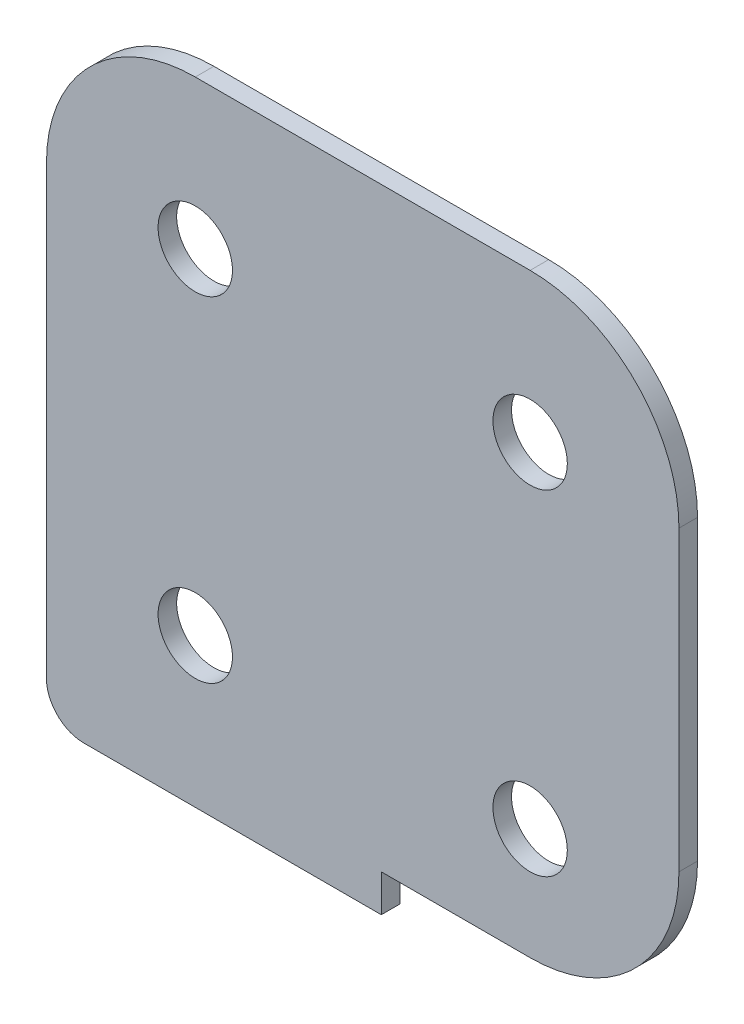
ISO-10303-21;
HEADER;
FILE_DESCRIPTION(('STEP AP214'),'2;1');
FILE_NAME('part.step','',(''),(''),'','','');
FILE_SCHEMA(('AUTOMOTIVE_DESIGN { 1 0 10303 214 1 1 1 1 }'));
ENDSEC;
DATA;
#1=APPLICATION_CONTEXT('core data for automotive mechanical design processes');
#2=APPLICATION_PROTOCOL_DEFINITION('international standard','automotive_design',2000,#1);
#3=PRODUCT_CONTEXT('',#1,'mechanical');
#4=PRODUCT('Part','Part','',(#3));
#5=PRODUCT_RELATED_PRODUCT_CATEGORY('part','',(#4));
#6=PRODUCT_DEFINITION_FORMATION('','',#4);
#7=PRODUCT_DEFINITION_CONTEXT('part definition',#1,'design');
#8=PRODUCT_DEFINITION('design','',#6,#7);
#9=PRODUCT_DEFINITION_SHAPE('','',#8);
#10=(LENGTH_UNIT() NAMED_UNIT(*) SI_UNIT(.MILLI.,.METRE.));
#11=(NAMED_UNIT(*) PLANE_ANGLE_UNIT() SI_UNIT($,.RADIAN.));
#12=(NAMED_UNIT(*) SI_UNIT($,.STERADIAN.) SOLID_ANGLE_UNIT());
#13=UNCERTAINTY_MEASURE_WITH_UNIT(LENGTH_MEASURE(1.E-05),#10,'distance_accuracy_value','');
#14=(GEOMETRIC_REPRESENTATION_CONTEXT(3) GLOBAL_UNCERTAINTY_ASSIGNED_CONTEXT((#13)) GLOBAL_UNIT_ASSIGNED_CONTEXT((#10,
#11,#12)) REPRESENTATION_CONTEXT('',''));
#15=CARTESIAN_POINT('',(0.,0.,0.));
#16=DIRECTION('',(0.,0.,1.));
#17=DIRECTION('',(1.,0.,0.));
#18=AXIS2_PLACEMENT_3D('',#15,#16,#17);
#19=CARTESIAN_POINT('',(0.,0.,1.5875));
#20=DIRECTION('',(0.,1.,0.));
#21=DIRECTION('',(0.,0.,1.));
#22=AXIS2_PLACEMENT_3D('',#19,#20,#21);
#23=PLANE('',#22);
#24=DIRECTION('',(1.,0.,0.));
#25=VECTOR('',#24,1.);
#26=CARTESIAN_POINT('',(0.,0.,0.));
#27=LINE('',#26,#25);
#28=CARTESIAN_POINT('',(-25.4,0.,0.));
#29=VERTEX_POINT('',#28);
#30=CARTESIAN_POINT('',(-12.7,0.,0.));
#31=VERTEX_POINT('',#30);
#32=EDGE_CURVE('E141',#29,#31,#27,.T.);
#33=ORIENTED_EDGE('',*,*,#32,.T.);
#34=DIRECTION('',(0.,0.,-1.));
#35=VECTOR('',#34,1.);
#36=CARTESIAN_POINT('',(-12.7,0.,1.5875));
#37=LINE('',#36,#35);
#38=CARTESIAN_POINT('',(-12.7,0.,1.5875));
#39=VERTEX_POINT('',#38);
#40=EDGE_CURVE('E121',#39,#31,#37,.T.);
#41=ORIENTED_EDGE('',*,*,#40,.F.);
#42=DIRECTION('',(1.,0.,0.));
#43=VECTOR('',#42,1.);
#44=CARTESIAN_POINT('',(0.,0.,1.5875));
#45=LINE('',#44,#43);
#46=CARTESIAN_POINT('',(-25.4,0.,1.5875));
#47=VERTEX_POINT('',#46);
#48=EDGE_CURVE('E129',#47,#39,#45,.T.);
#49=ORIENTED_EDGE('',*,*,#48,.F.);
#50=DIRECTION('',(0.,0.,-1.));
#51=VECTOR('',#50,1.);
#52=CARTESIAN_POINT('',(-25.4,0.,1.5875));
#53=LINE('',#52,#51);
#54=EDGE_CURVE('E172',#47,#29,#53,.T.);
#55=ORIENTED_EDGE('',*,*,#54,.T.);
#56=EDGE_LOOP('',(#33,#41,#49,#55));
#57=FACE_BOUND('',#56,.T.);
#58=ADVANCED_FACE('F41',(#57),#23,.F.);
#59=CARTESIAN_POINT('',(-12.7,12.7,1.5875));
#60=DIRECTION('',(0.,0.,-1.));
#61=DIRECTION('',(-1.,0.,0.));
#62=AXIS2_PLACEMENT_3D('',#59,#60,#61);
#63=CYLINDRICAL_SURFACE('',#62,12.7);
#64=CARTESIAN_POINT('',(-12.7,12.7,0.));
#65=DIRECTION('',(0.,0.,1.));
#66=DIRECTION('',(1.,0.,0.));
#67=AXIS2_PLACEMENT_3D('',#64,#65,#66);
#68=CIRCLE('',#67,12.7);
#69=CARTESIAN_POINT('',(0.,12.7,0.));
#70=VERTEX_POINT('',#69);
#71=EDGE_CURVE('E201',#31,#70,#68,.T.);
#72=ORIENTED_EDGE('',*,*,#71,.T.);
#73=DIRECTION('',(0.,0.,-1.));
#74=VECTOR('',#73,1.);
#75=CARTESIAN_POINT('',(0.,12.7,1.5875));
#76=LINE('',#75,#74);
#77=CARTESIAN_POINT('',(0.,12.7,1.5875));
#78=VERTEX_POINT('',#77);
#79=EDGE_CURVE('E124',#78,#70,#76,.T.);
#80=ORIENTED_EDGE('',*,*,#79,.F.);
#81=CARTESIAN_POINT('',(-12.7,12.7,1.5875));
#82=DIRECTION('',(0.,0.,1.));
#83=DIRECTION('',(1.,0.,0.));
#84=AXIS2_PLACEMENT_3D('',#81,#82,#83);
#85=CIRCLE('',#84,12.7);
#86=EDGE_CURVE('E117',#39,#78,#85,.T.);
#87=ORIENTED_EDGE('',*,*,#86,.F.);
#88=ORIENTED_EDGE('',*,*,#40,.T.);
#89=EDGE_LOOP('',(#72,#80,#87,#88));
#90=FACE_BOUND('',#89,.T.);
#91=ADVANCED_FACE('F119',(#90),#63,.T.);
#92=CARTESIAN_POINT('',(0.,0.,1.5875));
#93=DIRECTION('',(-1.,0.,0.));
#94=DIRECTION('',(0.,0.,1.));
#95=AXIS2_PLACEMENT_3D('',#92,#93,#94);
#96=PLANE('',#95);
#97=DIRECTION('',(0.,1.,0.));
#98=VECTOR('',#97,1.);
#99=CARTESIAN_POINT('',(0.,0.,0.));
#100=LINE('',#99,#98);
#101=CARTESIAN_POINT('',(0.,38.1,0.));
#102=VERTEX_POINT('',#101);
#103=EDGE_CURVE('E197',#70,#102,#100,.T.);
#104=ORIENTED_EDGE('',*,*,#103,.T.);
#105=DIRECTION('',(0.,0.,-1.));
#106=VECTOR('',#105,1.);
#107=CARTESIAN_POINT('',(0.,38.1,1.5875));
#108=LINE('',#107,#106);
#109=CARTESIAN_POINT('',(0.,38.1,1.5875));
#110=VERTEX_POINT('',#109);
#111=EDGE_CURVE('E149',#110,#102,#108,.T.);
#112=ORIENTED_EDGE('',*,*,#111,.F.);
#113=DIRECTION('',(0.,1.,0.));
#114=VECTOR('',#113,1.);
#115=CARTESIAN_POINT('',(0.,0.,1.5875));
#116=LINE('',#115,#114);
#117=EDGE_CURVE('E128',#78,#110,#116,.T.);
#118=ORIENTED_EDGE('',*,*,#117,.F.);
#119=ORIENTED_EDGE('',*,*,#79,.T.);
#120=EDGE_LOOP('',(#104,#112,#118,#119));
#121=FACE_BOUND('',#120,.T.);
#122=ADVANCED_FACE('F291',(#121),#96,.F.);
#123=CARTESIAN_POINT('',(-12.7,38.1,1.5875));
#124=DIRECTION('',(0.,0.,-1.));
#125=DIRECTION('',(-1.,0.,0.));
#126=AXIS2_PLACEMENT_3D('',#123,#124,#125);
#127=CYLINDRICAL_SURFACE('',#126,12.7);
#128=CARTESIAN_POINT('',(-12.7,38.1,0.));
#129=DIRECTION('',(0.,0.,1.));
#130=DIRECTION('',(1.,0.,0.));
#131=AXIS2_PLACEMENT_3D('',#128,#129,#130);
#132=CIRCLE('',#131,12.7);
#133=CARTESIAN_POINT('',(-12.7,50.8,0.));
#134=VERTEX_POINT('',#133);
#135=EDGE_CURVE('E193',#134,#102,#132,.F.);
#136=ORIENTED_EDGE('',*,*,#135,.F.);
#137=DIRECTION('',(0.,0.,-1.));
#138=VECTOR('',#137,1.);
#139=CARTESIAN_POINT('',(-12.7,50.8,1.5875));
#140=LINE('',#139,#138);
#141=CARTESIAN_POINT('',(-12.7,50.8,1.5875));
#142=VERTEX_POINT('',#141);
#143=EDGE_CURVE('E157',#142,#134,#140,.T.);
#144=ORIENTED_EDGE('',*,*,#143,.F.);
#145=CARTESIAN_POINT('',(-12.7,38.1,1.5875));
#146=DIRECTION('',(0.,0.,1.));
#147=DIRECTION('',(1.,0.,0.));
#148=AXIS2_PLACEMENT_3D('',#145,#146,#147);
#149=CIRCLE('',#148,12.7);
#150=EDGE_CURVE('E237',#142,#110,#149,.F.);
#151=ORIENTED_EDGE('',*,*,#150,.T.);
#152=ORIENTED_EDGE('',*,*,#111,.T.);
#153=EDGE_LOOP('',(#136,#144,#151,#152));
#154=FACE_BOUND('',#153,.T.);
#155=ADVANCED_FACE('F298',(#154),#127,.T.);
#156=CARTESIAN_POINT('',(0.,50.8,1.5875));
#157=DIRECTION('',(0.,-1.,0.));
#158=DIRECTION('',(1.,0.,0.));
#159=AXIS2_PLACEMENT_3D('',#156,#157,#158);
#160=PLANE('',#159);
#161=DIRECTION('',(-1.,0.,0.));
#162=VECTOR('',#161,1.);
#163=CARTESIAN_POINT('',(0.,50.8,0.));
#164=LINE('',#163,#162);
#165=CARTESIAN_POINT('',(-41.275,50.8,0.));
#166=VERTEX_POINT('',#165);
#167=EDGE_CURVE('E190',#134,#166,#164,.T.);
#168=ORIENTED_EDGE('',*,*,#167,.T.);
#169=DIRECTION('',(0.,0.,-1.));
#170=VECTOR('',#169,1.);
#171=CARTESIAN_POINT('',(-41.275,50.8,1.5875));
#172=LINE('',#171,#170);
#173=CARTESIAN_POINT('',(-41.275,50.8,1.5875));
#174=VERTEX_POINT('',#173);
#175=EDGE_CURVE('E160',#174,#166,#172,.T.);
#176=ORIENTED_EDGE('',*,*,#175,.F.);
#177=DIRECTION('',(-1.,0.,0.));
#178=VECTOR('',#177,1.);
#179=CARTESIAN_POINT('',(0.,50.8,1.5875));
#180=LINE('',#179,#178);
#181=EDGE_CURVE('E234',#142,#174,#180,.T.);
#182=ORIENTED_EDGE('',*,*,#181,.F.);
#183=ORIENTED_EDGE('',*,*,#143,.T.);
#184=EDGE_LOOP('',(#168,#176,#182,#183));
#185=FACE_BOUND('',#184,.T.);
#186=ADVANCED_FACE('F301',(#185),#160,.F.);
#187=CARTESIAN_POINT('',(-41.275,38.1,1.5875));
#188=DIRECTION('',(0.,0.,-1.));
#189=DIRECTION('',(-1.,0.,0.));
#190=AXIS2_PLACEMENT_3D('',#187,#188,#189);
#191=CYLINDRICAL_SURFACE('',#190,12.7);
#192=CARTESIAN_POINT('',(-41.275,38.1,0.));
#193=DIRECTION('',(0.,0.,1.));
#194=DIRECTION('',(1.,0.,0.));
#195=AXIS2_PLACEMENT_3D('',#192,#193,#194);
#196=CIRCLE('',#195,12.7);
#197=CARTESIAN_POINT('',(-53.975,38.1,0.));
#198=VERTEX_POINT('',#197);
#199=EDGE_CURVE('E186',#166,#198,#196,.T.);
#200=ORIENTED_EDGE('',*,*,#199,.T.);
#201=DIRECTION('',(0.,0.,-1.));
#202=VECTOR('',#201,1.);
#203=CARTESIAN_POINT('',(-53.975,38.1,1.5875));
#204=LINE('',#203,#202);
#205=CARTESIAN_POINT('',(-53.975,38.1,1.5875));
#206=VERTEX_POINT('',#205);
#207=EDGE_CURVE('E164',#206,#198,#204,.T.);
#208=ORIENTED_EDGE('',*,*,#207,.F.);
#209=CARTESIAN_POINT('',(-41.275,38.1,1.5875));
#210=DIRECTION('',(0.,0.,1.));
#211=DIRECTION('',(1.,0.,0.));
#212=AXIS2_PLACEMENT_3D('',#209,#210,#211);
#213=CIRCLE('',#212,12.7);
#214=EDGE_CURVE('E230',#174,#206,#213,.T.);
#215=ORIENTED_EDGE('',*,*,#214,.F.);
#216=ORIENTED_EDGE('',*,*,#175,.T.);
#217=EDGE_LOOP('',(#200,#208,#215,#216));
#218=FACE_BOUND('',#217,.T.);
#219=ADVANCED_FACE('F306',(#218),#191,.T.);
#220=CARTESIAN_POINT('',(-53.975,0.,1.5875));
#221=DIRECTION('',(-1.,0.,0.));
#222=DIRECTION('',(0.,0.,1.));
#223=AXIS2_PLACEMENT_3D('',#220,#221,#222);
#224=PLANE('',#223);
#225=DIRECTION('',(0.,1.,0.));
#226=VECTOR('',#225,1.);
#227=CARTESIAN_POINT('',(-53.975,0.,0.));
#228=LINE('',#227,#226);
#229=CARTESIAN_POINT('',(-53.975,0.,0.));
#230=VERTEX_POINT('',#229);
#231=EDGE_CURVE('E183',#230,#198,#228,.T.);
#232=ORIENTED_EDGE('',*,*,#231,.F.);
#233=DIRECTION('',(0.,0.,-1.));
#234=VECTOR('',#233,1.);
#235=CARTESIAN_POINT('',(-53.975,0.,1.5875));
#236=LINE('',#235,#234);
#237=CARTESIAN_POINT('',(-53.975,0.,1.5875));
#238=VERTEX_POINT('',#237);
#239=EDGE_CURVE('E50',#230,#238,#236,.F.);
#240=ORIENTED_EDGE('',*,*,#239,.T.);
#241=DIRECTION('',(0.,1.,0.));
#242=VECTOR('',#241,1.);
#243=CARTESIAN_POINT('',(-53.975,0.,1.5875));
#244=LINE('',#243,#242);
#245=EDGE_CURVE('E227',#238,#206,#244,.T.);
#246=ORIENTED_EDGE('',*,*,#245,.T.);
#247=ORIENTED_EDGE('',*,*,#207,.T.);
#248=EDGE_LOOP('',(#232,#240,#246,#247));
#249=FACE_BOUND('',#248,.T.);
#250=ADVANCED_FACE('F336',(#249),#224,.T.);
#251=CARTESIAN_POINT('',(0.,-3.175,1.5875));
#252=DIRECTION('',(0.,1.,0.));
#253=DIRECTION('',(0.,0.,1.));
#254=AXIS2_PLACEMENT_3D('',#251,#252,#253);
#255=PLANE('',#254);
#256=DIRECTION('',(1.,0.,0.));
#257=VECTOR('',#256,1.);
#258=CARTESIAN_POINT('',(0.,-3.175,1.5875));
#259=LINE('',#258,#257);
#260=CARTESIAN_POINT('',(-50.8,-3.175,1.5875));
#261=VERTEX_POINT('',#260);
#262=CARTESIAN_POINT('',(-25.4,-3.175,1.5875));
#263=VERTEX_POINT('',#262);
#264=EDGE_CURVE('E224',#261,#263,#259,.T.);
#265=ORIENTED_EDGE('',*,*,#264,.F.);
#266=DIRECTION('',(0.,0.,-1.));
#267=VECTOR('',#266,1.);
#268=CARTESIAN_POINT('',(-50.8,-3.175,0.));
#269=LINE('',#268,#267);
#270=CARTESIAN_POINT('',(-50.8,-3.175,0.));
#271=VERTEX_POINT('',#270);
#272=EDGE_CURVE('E143',#261,#271,#269,.T.);
#273=ORIENTED_EDGE('',*,*,#272,.T.);
#274=DIRECTION('',(1.,0.,0.));
#275=VECTOR('',#274,1.);
#276=CARTESIAN_POINT('',(0.,-3.175,0.));
#277=LINE('',#276,#275);
#278=CARTESIAN_POINT('',(-25.4,-3.175,0.));
#279=VERTEX_POINT('',#278);
#280=EDGE_CURVE('E180',#271,#279,#277,.T.);
#281=ORIENTED_EDGE('',*,*,#280,.T.);
#282=DIRECTION('',(0.,0.,-1.));
#283=VECTOR('',#282,1.);
#284=CARTESIAN_POINT('',(-25.4,-3.175,1.5875));
#285=LINE('',#284,#283);
#286=EDGE_CURVE('E168',#263,#279,#285,.T.);
#287=ORIENTED_EDGE('',*,*,#286,.F.);
#288=EDGE_LOOP('',(#265,#273,#281,#287));
#289=FACE_BOUND('',#288,.T.);
#290=ADVANCED_FACE('F276',(#289),#255,.F.);
#291=CARTESIAN_POINT('',(-41.275,38.1,1.5875));
#292=DIRECTION('',(0.,0.,-1.));
#293=DIRECTION('',(-1.,0.,0.));
#294=AXIS2_PLACEMENT_3D('',#291,#292,#293);
#295=CYLINDRICAL_SURFACE('',#294,3.175);
#296=CARTESIAN_POINT('',(-41.275,38.1,1.5875));
#297=DIRECTION('',(0.,0.,1.));
#298=DIRECTION('',(1.,0.,0.));
#299=AXIS2_PLACEMENT_3D('',#296,#297,#298);
#300=CIRCLE('',#299,3.175);
#301=CARTESIAN_POINT('',(-38.1,38.1,1.5875));
#302=VERTEX_POINT('',#301);
#303=EDGE_CURVE('E138',#302,#302,#300,.T.);
#304=ORIENTED_EDGE('',*,*,#303,.T.);
#305=EDGE_LOOP('',(#304));
#306=FACE_BOUND('',#305,.T.);
#307=CARTESIAN_POINT('',(-41.275,38.1,0.));
#308=DIRECTION('',(0.,0.,1.));
#309=DIRECTION('',(1.,0.,0.));
#310=AXIS2_PLACEMENT_3D('',#307,#308,#309);
#311=CIRCLE('',#310,3.175);
#312=CARTESIAN_POINT('',(-38.1,38.1,0.));
#313=VERTEX_POINT('',#312);
#314=EDGE_CURVE('E206',#313,#313,#311,.T.);
#315=ORIENTED_EDGE('',*,*,#314,.F.);
#316=EDGE_LOOP('',(#315));
#317=FACE_BOUND('',#316,.T.);
#318=ADVANCED_FACE('F272',(#306,#317),#295,.F.);
#319=CARTESIAN_POINT('',(-41.275,9.525,1.5875));
#320=DIRECTION('',(0.,0.,-1.));
#321=DIRECTION('',(-1.,0.,0.));
#322=AXIS2_PLACEMENT_3D('',#319,#320,#321);
#323=CYLINDRICAL_SURFACE('',#322,3.175);
#324=CARTESIAN_POINT('',(-41.275,9.525,1.5875));
#325=DIRECTION('',(0.,0.,1.));
#326=DIRECTION('',(1.,0.,0.));
#327=AXIS2_PLACEMENT_3D('',#324,#325,#326);
#328=CIRCLE('',#327,3.175);
#329=CARTESIAN_POINT('',(-38.1,9.525,1.5875));
#330=VERTEX_POINT('',#329);
#331=EDGE_CURVE('E246',#330,#330,#328,.T.);
#332=ORIENTED_EDGE('',*,*,#331,.T.);
#333=EDGE_LOOP('',(#332));
#334=FACE_BOUND('',#333,.T.);
#335=CARTESIAN_POINT('',(-41.275,9.525,0.));
#336=DIRECTION('',(0.,0.,1.));
#337=DIRECTION('',(1.,0.,0.));
#338=AXIS2_PLACEMENT_3D('',#335,#336,#337);
#339=CIRCLE('',#338,3.175);
#340=CARTESIAN_POINT('',(-38.1,9.525,0.));
#341=VERTEX_POINT('',#340);
#342=EDGE_CURVE('E210',#341,#341,#339,.T.);
#343=ORIENTED_EDGE('',*,*,#342,.F.);
#344=EDGE_LOOP('',(#343));
#345=FACE_BOUND('',#344,.T.);
#346=ADVANCED_FACE('F275',(#334,#345),#323,.F.);
#347=CARTESIAN_POINT('',(-12.7,9.525,1.5875));
#348=DIRECTION('',(0.,0.,-1.));
#349=DIRECTION('',(-1.,0.,0.));
#350=AXIS2_PLACEMENT_3D('',#347,#348,#349);
#351=CYLINDRICAL_SURFACE('',#350,3.175);
#352=CARTESIAN_POINT('',(-12.7,9.525,1.5875));
#353=DIRECTION('',(0.,0.,1.));
#354=DIRECTION('',(1.,0.,0.));
#355=AXIS2_PLACEMENT_3D('',#352,#353,#354);
#356=CIRCLE('',#355,3.175);
#357=CARTESIAN_POINT('',(-9.525,9.525,1.5875));
#358=VERTEX_POINT('',#357);
#359=EDGE_CURVE('E250',#358,#358,#356,.T.);
#360=ORIENTED_EDGE('',*,*,#359,.T.);
#361=EDGE_LOOP('',(#360));
#362=FACE_BOUND('',#361,.T.);
#363=CARTESIAN_POINT('',(-12.7,9.525,0.));
#364=DIRECTION('',(0.,0.,1.));
#365=DIRECTION('',(1.,0.,0.));
#366=AXIS2_PLACEMENT_3D('',#363,#364,#365);
#367=CIRCLE('',#366,3.175);
#368=CARTESIAN_POINT('',(-9.525,9.525,0.));
#369=VERTEX_POINT('',#368);
#370=EDGE_CURVE('E214',#369,#369,#367,.T.);
#371=ORIENTED_EDGE('',*,*,#370,.F.);
#372=EDGE_LOOP('',(#371));
#373=FACE_BOUND('',#372,.T.);
#374=ADVANCED_FACE('F322',(#362,#373),#351,.F.);
#375=CARTESIAN_POINT('',(-12.7,38.1,1.5875));
#376=DIRECTION('',(0.,0.,-1.));
#377=DIRECTION('',(-1.,0.,0.));
#378=AXIS2_PLACEMENT_3D('',#375,#376,#377);
#379=CYLINDRICAL_SURFACE('',#378,3.175);
#380=CARTESIAN_POINT('',(-12.7,38.1,1.5875));
#381=DIRECTION('',(0.,0.,1.));
#382=DIRECTION('',(1.,0.,0.));
#383=AXIS2_PLACEMENT_3D('',#380,#381,#382);
#384=CIRCLE('',#383,3.175);
#385=CARTESIAN_POINT('',(-9.525,38.1,1.5875));
#386=VERTEX_POINT('',#385);
#387=EDGE_CURVE('E179',#386,#386,#384,.T.);
#388=ORIENTED_EDGE('',*,*,#387,.T.);
#389=EDGE_LOOP('',(#388));
#390=FACE_BOUND('',#389,.T.);
#391=CARTESIAN_POINT('',(-12.7,38.1,0.));
#392=DIRECTION('',(0.,0.,1.));
#393=DIRECTION('',(1.,0.,0.));
#394=AXIS2_PLACEMENT_3D('',#391,#392,#393);
#395=CIRCLE('',#394,3.175);
#396=CARTESIAN_POINT('',(-9.525,38.1,0.));
#397=VERTEX_POINT('',#396);
#398=EDGE_CURVE('E218',#397,#397,#395,.T.);
#399=ORIENTED_EDGE('',*,*,#398,.F.);
#400=EDGE_LOOP('',(#399));
#401=FACE_BOUND('',#400,.T.);
#402=ADVANCED_FACE('F258',(#390,#401),#379,.F.);
#403=CARTESIAN_POINT('',(-25.4,0.,1.5875));
#404=DIRECTION('',(1.,0.,0.));
#405=DIRECTION('',(0.,1.,0.));
#406=AXIS2_PLACEMENT_3D('',#403,#404,#405);
#407=PLANE('',#406);
#408=DIRECTION('',(0.,-1.,0.));
#409=VECTOR('',#408,1.);
#410=CARTESIAN_POINT('',(-25.4,0.,0.));
#411=LINE('',#410,#409);
#412=EDGE_CURVE('E175',#29,#279,#411,.T.);
#413=ORIENTED_EDGE('',*,*,#412,.F.);
#414=ORIENTED_EDGE('',*,*,#54,.F.);
#415=DIRECTION('',(0.,-1.,0.));
#416=VECTOR('',#415,1.);
#417=CARTESIAN_POINT('',(-25.4,0.,1.5875));
#418=LINE('',#417,#416);
#419=EDGE_CURVE('E135',#47,#263,#418,.T.);
#420=ORIENTED_EDGE('',*,*,#419,.T.);
#421=ORIENTED_EDGE('',*,*,#286,.T.);
#422=EDGE_LOOP('',(#413,#414,#420,#421));
#423=FACE_BOUND('',#422,.T.);
#424=ADVANCED_FACE('F264',(#423),#407,.T.);
#425=CARTESIAN_POINT('',(0.,0.,1.5875));
#426=DIRECTION('',(0.,0.,1.));
#427=DIRECTION('',(1.,0.,0.));
#428=AXIS2_PLACEMENT_3D('',#425,#426,#427);
#429=PLANE('',#428);
#430=ORIENTED_EDGE('',*,*,#387,.F.);
#431=EDGE_LOOP('',(#430));
#432=FACE_BOUND('',#431,.T.);
#433=ORIENTED_EDGE('',*,*,#359,.F.);
#434=EDGE_LOOP('',(#433));
#435=FACE_BOUND('',#434,.T.);
#436=ORIENTED_EDGE('',*,*,#331,.F.);
#437=EDGE_LOOP('',(#436));
#438=FACE_BOUND('',#437,.T.);
#439=ORIENTED_EDGE('',*,*,#303,.F.);
#440=EDGE_LOOP('',(#439));
#441=FACE_BOUND('',#440,.T.);
#442=ORIENTED_EDGE('',*,*,#245,.F.);
#443=CARTESIAN_POINT('',(-50.8,0.,1.5875));
#444=DIRECTION('',(0.,0.,1.));
#445=DIRECTION('',(1.,0.,0.));
#446=AXIS2_PLACEMENT_3D('',#443,#444,#445);
#447=CIRCLE('',#446,3.175);
#448=EDGE_CURVE('E11',#238,#261,#447,.T.);
#449=ORIENTED_EDGE('',*,*,#448,.T.);
#450=ORIENTED_EDGE('',*,*,#264,.T.);
#451=ORIENTED_EDGE('',*,*,#419,.F.);
#452=ORIENTED_EDGE('',*,*,#48,.T.);
#453=ORIENTED_EDGE('',*,*,#86,.T.);
#454=ORIENTED_EDGE('',*,*,#117,.T.);
#455=ORIENTED_EDGE('',*,*,#150,.F.);
#456=ORIENTED_EDGE('',*,*,#181,.T.);
#457=ORIENTED_EDGE('',*,*,#214,.T.);
#458=EDGE_LOOP('',(#442,#449,#450,#451,#452,#453,#454,#455,#456,#457));
#459=FACE_BOUND('',#458,.T.);
#460=ADVANCED_FACE('F133',(#432,#435,#438,#441,#459),#429,.T.);
#461=CARTESIAN_POINT('',(0.,0.,0.));
#462=DIRECTION('',(0.,0.,1.));
#463=DIRECTION('',(1.,0.,0.));
#464=AXIS2_PLACEMENT_3D('',#461,#462,#463);
#465=PLANE('',#464);
#466=ORIENTED_EDGE('',*,*,#398,.T.);
#467=EDGE_LOOP('',(#466));
#468=FACE_BOUND('',#467,.T.);
#469=ORIENTED_EDGE('',*,*,#370,.T.);
#470=EDGE_LOOP('',(#469));
#471=FACE_BOUND('',#470,.T.);
#472=ORIENTED_EDGE('',*,*,#342,.T.);
#473=EDGE_LOOP('',(#472));
#474=FACE_BOUND('',#473,.T.);
#475=ORIENTED_EDGE('',*,*,#314,.T.);
#476=EDGE_LOOP('',(#475));
#477=FACE_BOUND('',#476,.T.);
#478=ORIENTED_EDGE('',*,*,#280,.F.);
#479=CARTESIAN_POINT('',(-50.8,0.,0.));
#480=DIRECTION('',(0.,0.,1.));
#481=DIRECTION('',(1.,0.,0.));
#482=AXIS2_PLACEMENT_3D('',#479,#480,#481);
#483=CIRCLE('',#482,3.175);
#484=EDGE_CURVE('E64',#271,#230,#483,.F.);
#485=ORIENTED_EDGE('',*,*,#484,.T.);
#486=ORIENTED_EDGE('',*,*,#231,.T.);
#487=ORIENTED_EDGE('',*,*,#199,.F.);
#488=ORIENTED_EDGE('',*,*,#167,.F.);
#489=ORIENTED_EDGE('',*,*,#135,.T.);
#490=ORIENTED_EDGE('',*,*,#103,.F.);
#491=ORIENTED_EDGE('',*,*,#71,.F.);
#492=ORIENTED_EDGE('',*,*,#32,.F.);
#493=ORIENTED_EDGE('',*,*,#412,.T.);
#494=EDGE_LOOP('',(#478,#485,#486,#487,#488,#489,#490,#491,#492,#493));
#495=FACE_BOUND('',#494,.T.);
#496=ADVANCED_FACE('F263',(#468,#471,#474,#477,#495),#465,.F.);
#497=CARTESIAN_POINT('',(-50.8,0.,1.5875));
#498=DIRECTION('',(0.,0.,1.));
#499=DIRECTION('',(1.,0.,0.));
#500=AXIS2_PLACEMENT_3D('',#497,#498,#499);
#501=CYLINDRICAL_SURFACE('',#500,3.175);
#502=ORIENTED_EDGE('',*,*,#448,.F.);
#503=ORIENTED_EDGE('',*,*,#239,.F.);
#504=ORIENTED_EDGE('',*,*,#484,.F.);
#505=ORIENTED_EDGE('',*,*,#272,.F.);
#506=EDGE_LOOP('',(#502,#503,#504,#505));
#507=FACE_BOUND('',#506,.T.);
#508=ADVANCED_FACE('F43',(#507),#501,.T.);
#509=CLOSED_SHELL('',(#58,#91,#122,#155,#186,#219,#250,#290,#318,#346,#374,#402,#424,#460,#496,#508));
#510=MANIFOLD_SOLID_BREP('B2',#509);
#511=ADVANCED_BREP_SHAPE_REPRESENTATION('',(#18,#510),#14);
#512=SHAPE_DEFINITION_REPRESENTATION(#9,#511);
ENDSEC;
END-ISO-10303-21;
